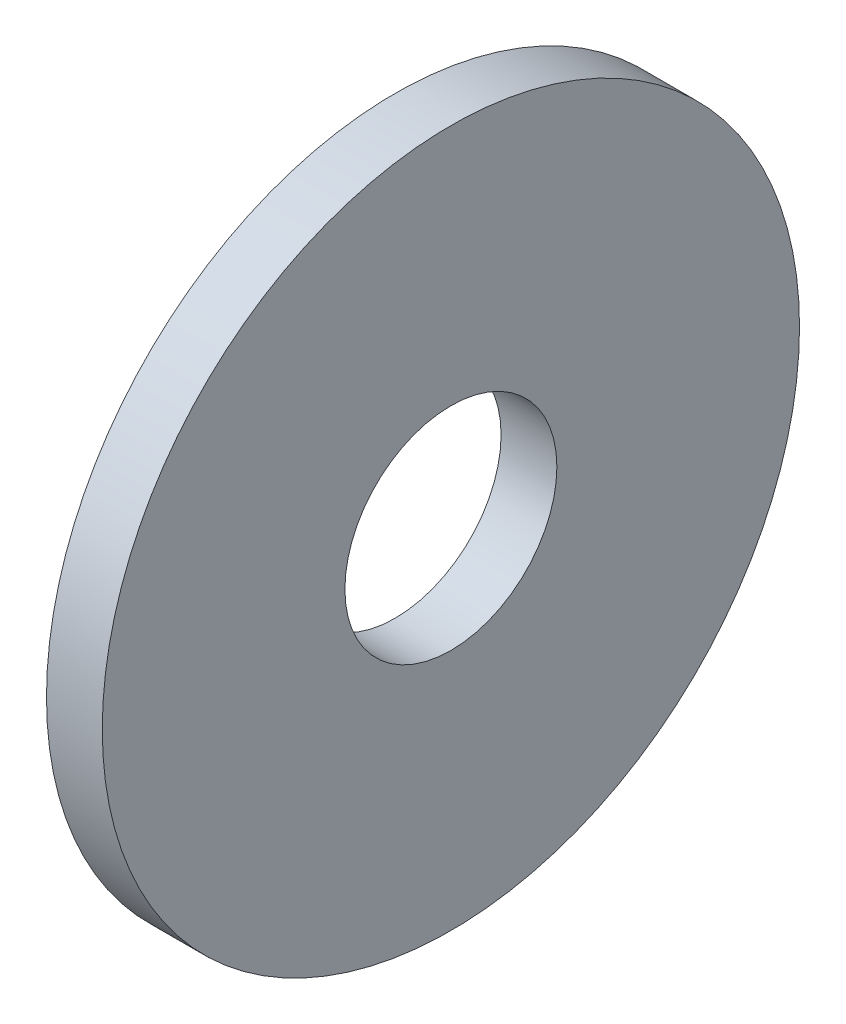
ISO-10303-21;
HEADER;
FILE_DESCRIPTION(('STEP AP214'),'2;1');
FILE_NAME('part.step','',(''),(''),'','','');
FILE_SCHEMA(('AUTOMOTIVE_DESIGN { 1 0 10303 214 1 1 1 1 }'));
ENDSEC;
DATA;
#1=APPLICATION_CONTEXT('core data for automotive mechanical design processes');
#2=APPLICATION_PROTOCOL_DEFINITION('international standard','automotive_design',2000,#1);
#3=PRODUCT_CONTEXT('',#1,'mechanical');
#4=PRODUCT('Part','Part','',(#3));
#5=PRODUCT_RELATED_PRODUCT_CATEGORY('part','',(#4));
#6=PRODUCT_DEFINITION_FORMATION('','',#4);
#7=PRODUCT_DEFINITION_CONTEXT('part definition',#1,'design');
#8=PRODUCT_DEFINITION('design','',#6,#7);
#9=PRODUCT_DEFINITION_SHAPE('','',#8);
#10=(LENGTH_UNIT() NAMED_UNIT(*) SI_UNIT(.MILLI.,.METRE.));
#11=(NAMED_UNIT(*) PLANE_ANGLE_UNIT() SI_UNIT($,.RADIAN.));
#12=(NAMED_UNIT(*) SI_UNIT($,.STERADIAN.) SOLID_ANGLE_UNIT());
#13=UNCERTAINTY_MEASURE_WITH_UNIT(LENGTH_MEASURE(1.E-05),#10,'distance_accuracy_value','');
#14=(GEOMETRIC_REPRESENTATION_CONTEXT(3) GLOBAL_UNCERTAINTY_ASSIGNED_CONTEXT((#13)) GLOBAL_UNIT_ASSIGNED_CONTEXT((#10,
#11,#12)) REPRESENTATION_CONTEXT('',''));
#15=CARTESIAN_POINT('',(0.,0.,0.));
#16=DIRECTION('',(0.,0.,1.));
#17=DIRECTION('',(1.,0.,0.));
#18=AXIS2_PLACEMENT_3D('',#15,#16,#17);
#19=CARTESIAN_POINT('',(0.,0.,0.));
#20=DIRECTION('',(1.,0.,0.));
#21=DIRECTION('',(0.,0.,-1.));
#22=AXIS2_PLACEMENT_3D('',#19,#20,#21);
#23=PLANE('',#22);
#24=CARTESIAN_POINT('',(0.,0.,0.));
#25=DIRECTION('',(-1.,0.,0.));
#26=DIRECTION('',(0.,0.,1.));
#27=AXIS2_PLACEMENT_3D('',#24,#25,#26);
#28=CIRCLE('',#27,3.3782);
#29=CARTESIAN_POINT('',(0.,0.,3.3782));
#30=VERTEX_POINT('',#29);
#31=EDGE_CURVE('E27',#30,#30,#28,.F.);
#32=ORIENTED_EDGE('',*,*,#31,.T.);
#33=EDGE_LOOP('',(#32));
#34=FACE_BOUND('',#33,.T.);
#35=CARTESIAN_POINT('',(0.,0.,0.));
#36=DIRECTION('',(-1.,0.,0.));
#37=DIRECTION('',(0.,0.,1.));
#38=AXIS2_PLACEMENT_3D('',#35,#36,#37);
#39=CIRCLE('',#38,11.1125);
#40=CARTESIAN_POINT('',(0.,0.,11.1125));
#41=VERTEX_POINT('',#40);
#42=EDGE_CURVE('E19',#41,#41,#39,.F.);
#43=ORIENTED_EDGE('',*,*,#42,.F.);
#44=EDGE_LOOP('',(#43));
#45=FACE_BOUND('',#44,.T.);
#46=ADVANCED_FACE('F16',(#34,#45),#23,.F.);
#47=CARTESIAN_POINT('',(1.778,0.,0.));
#48=DIRECTION('',(-1.,0.,0.));
#49=DIRECTION('',(0.,0.,1.));
#50=AXIS2_PLACEMENT_3D('',#47,#48,#49);
#51=CYLINDRICAL_SURFACE('',#50,11.1125);
#52=ORIENTED_EDGE('',*,*,#42,.T.);
#53=EDGE_LOOP('',(#52));
#54=FACE_BOUND('',#53,.T.);
#55=CARTESIAN_POINT('',(1.778,0.,0.));
#56=DIRECTION('',(-1.,0.,0.));
#57=DIRECTION('',(0.,0.,1.));
#58=AXIS2_PLACEMENT_3D('',#55,#56,#57);
#59=CIRCLE('',#58,11.1125);
#60=CARTESIAN_POINT('',(1.778,0.,11.1125));
#61=VERTEX_POINT('',#60);
#62=EDGE_CURVE('E23',#61,#61,#59,.F.);
#63=ORIENTED_EDGE('',*,*,#62,.F.);
#64=EDGE_LOOP('',(#63));
#65=FACE_BOUND('',#64,.T.);
#66=ADVANCED_FACE('F36',(#54,#65),#51,.T.);
#67=CARTESIAN_POINT('',(1.778,0.,0.));
#68=DIRECTION('',(-1.,0.,0.));
#69=DIRECTION('',(0.,0.,1.));
#70=AXIS2_PLACEMENT_3D('',#67,#68,#69);
#71=CYLINDRICAL_SURFACE('',#70,3.3782);
#72=ORIENTED_EDGE('',*,*,#31,.F.);
#73=EDGE_LOOP('',(#72));
#74=FACE_BOUND('',#73,.T.);
#75=CARTESIAN_POINT('',(1.778,0.,0.));
#76=DIRECTION('',(-1.,0.,0.));
#77=DIRECTION('',(0.,0.,1.));
#78=AXIS2_PLACEMENT_3D('',#75,#76,#77);
#79=CIRCLE('',#78,3.3782);
#80=CARTESIAN_POINT('',(1.778,0.,3.3782));
#81=VERTEX_POINT('',#80);
#82=EDGE_CURVE('E11',#81,#81,#79,.T.);
#83=ORIENTED_EDGE('',*,*,#82,.F.);
#84=EDGE_LOOP('',(#83));
#85=FACE_BOUND('',#84,.T.);
#86=ADVANCED_FACE('F44',(#74,#85),#71,.F.);
#87=CARTESIAN_POINT('',(1.778,0.,0.));
#88=DIRECTION('',(1.,0.,0.));
#89=DIRECTION('',(0.,0.,-1.));
#90=AXIS2_PLACEMENT_3D('',#87,#88,#89);
#91=PLANE('',#90);
#92=ORIENTED_EDGE('',*,*,#82,.T.);
#93=EDGE_LOOP('',(#92));
#94=FACE_BOUND('',#93,.T.);
#95=ORIENTED_EDGE('',*,*,#62,.T.);
#96=EDGE_LOOP('',(#95));
#97=FACE_BOUND('',#96,.T.);
#98=ADVANCED_FACE('F45',(#94,#97),#91,.T.);
#99=CLOSED_SHELL('',(#46,#66,#86,#98));
#100=MANIFOLD_SOLID_BREP('B1',#99);
#101=ADVANCED_BREP_SHAPE_REPRESENTATION('',(#18,#100),#14);
#102=SHAPE_DEFINITION_REPRESENTATION(#9,#101);
ENDSEC;
END-ISO-10303-21;
